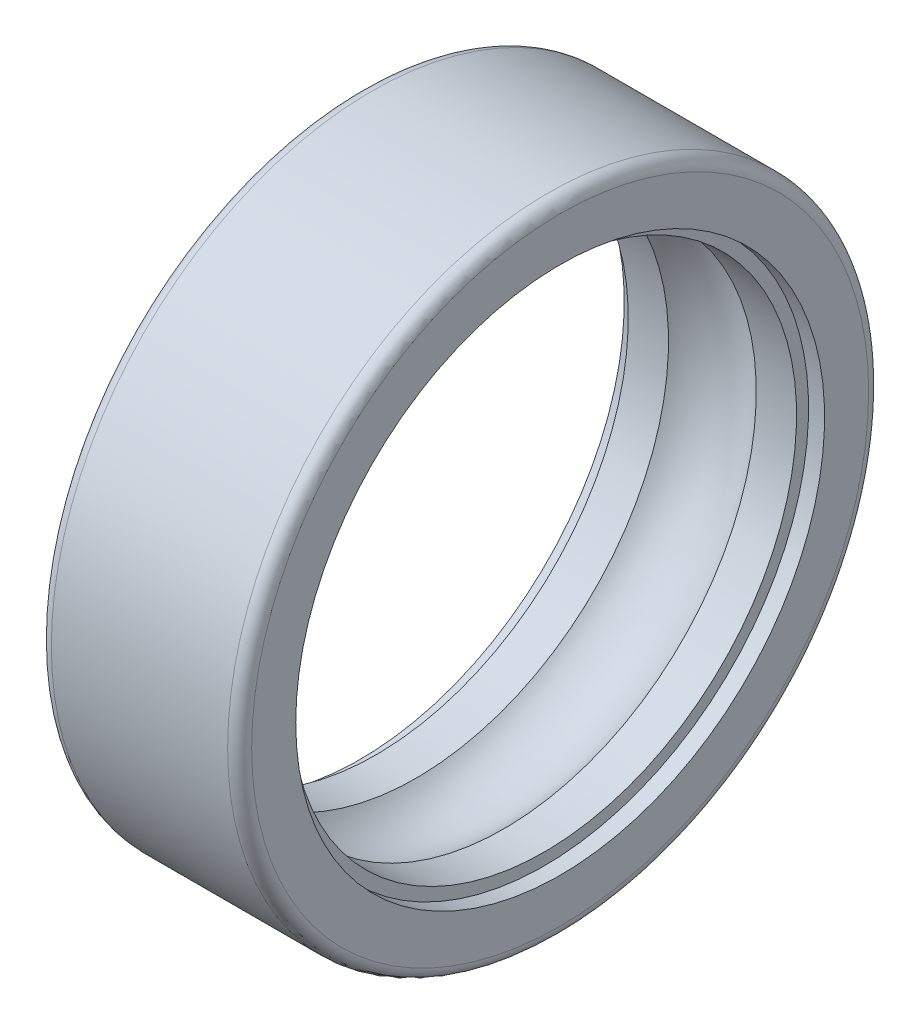
ISO-10303-21;
HEADER;
FILE_DESCRIPTION(('STEP AP214'),'2;1');
FILE_NAME('part.step','',(''),(''),'','','');
FILE_SCHEMA(('AUTOMOTIVE_DESIGN { 1 0 10303 214 1 1 1 1 }'));
ENDSEC;
DATA;
#1=APPLICATION_CONTEXT('core data for automotive mechanical design processes');
#2=APPLICATION_PROTOCOL_DEFINITION('international standard','automotive_design',2000,#1);
#3=PRODUCT_CONTEXT('',#1,'mechanical');
#4=PRODUCT('Part','Part','',(#3));
#5=PRODUCT_RELATED_PRODUCT_CATEGORY('part','',(#4));
#6=PRODUCT_DEFINITION_FORMATION('','',#4);
#7=PRODUCT_DEFINITION_CONTEXT('part definition',#1,'design');
#8=PRODUCT_DEFINITION('design','',#6,#7);
#9=PRODUCT_DEFINITION_SHAPE('','',#8);
#10=(LENGTH_UNIT() NAMED_UNIT(*) SI_UNIT(.MILLI.,.METRE.));
#11=(NAMED_UNIT(*) PLANE_ANGLE_UNIT() SI_UNIT($,.RADIAN.));
#12=(NAMED_UNIT(*) SI_UNIT($,.STERADIAN.) SOLID_ANGLE_UNIT());
#13=UNCERTAINTY_MEASURE_WITH_UNIT(LENGTH_MEASURE(1.E-05),#10,'distance_accuracy_value','');
#14=(GEOMETRIC_REPRESENTATION_CONTEXT(3) GLOBAL_UNCERTAINTY_ASSIGNED_CONTEXT((#13)) GLOBAL_UNIT_ASSIGNED_CONTEXT((#10,
#11,#12)) REPRESENTATION_CONTEXT('',''));
#15=CARTESIAN_POINT('',(0.,0.,0.));
#16=DIRECTION('',(0.,0.,1.));
#17=DIRECTION('',(1.,0.,0.));
#18=AXIS2_PLACEMENT_3D('',#15,#16,#17);
#19=CARTESIAN_POINT('',(2.5,0.,0.));
#20=DIRECTION('',(-1.,0.,0.));
#21=DIRECTION('',(0.,-1.,0.));
#22=AXIS2_PLACEMENT_3D('',#19,#20,#21);
#23=TOROIDAL_SURFACE('',#22,5.275,1.5);
#24=CARTESIAN_POINT('',(1.40484019430953,0.,0.));
#25=DIRECTION('',(1.,0.,0.));
#26=DIRECTION('',(0.,0.,1.));
#27=AXIS2_PLACEMENT_3D('',#24,#25,#26);
#28=CIRCLE('',#27,6.3);
#29=CARTESIAN_POINT('',(1.40484019430953,0.,6.3));
#30=VERTEX_POINT('',#29);
#31=EDGE_CURVE('E140',#30,#30,#28,.T.);
#32=ORIENTED_EDGE('',*,*,#31,.F.);
#33=EDGE_LOOP('',(#32));
#34=FACE_BOUND('',#33,.T.);
#35=CARTESIAN_POINT('',(3.59515980569047,0.,0.));
#36=DIRECTION('',(1.,0.,0.));
#37=DIRECTION('',(0.,0.,1.));
#38=AXIS2_PLACEMENT_3D('',#35,#36,#37);
#39=CIRCLE('',#38,6.3);
#40=CARTESIAN_POINT('',(3.59515980569047,0.,6.3));
#41=VERTEX_POINT('',#40);
#42=EDGE_CURVE('E129',#41,#41,#39,.F.);
#43=ORIENTED_EDGE('',*,*,#42,.F.);
#44=EDGE_LOOP('',(#43));
#45=FACE_BOUND('',#44,.T.);
#46=ADVANCED_FACE('F13',(#34,#45),#23,.F.);
#47=CARTESIAN_POINT('',(4.6,0.,0.));
#48=DIRECTION('',(-1.,0.,0.));
#49=DIRECTION('',(0.,0.,1.));
#50=AXIS2_PLACEMENT_3D('',#47,#48,#49);
#51=CYLINDRICAL_SURFACE('',#50,6.3);
#52=CARTESIAN_POINT('',(4.6,0.,0.));
#53=DIRECTION('',(-1.,0.,0.));
#54=DIRECTION('',(0.,0.,1.));
#55=AXIS2_PLACEMENT_3D('',#52,#53,#54);
#56=CIRCLE('',#55,6.3);
#57=CARTESIAN_POINT('',(4.6,0.,6.3));
#58=VERTEX_POINT('',#57);
#59=EDGE_CURVE('E17',#58,#58,#56,.T.);
#60=ORIENTED_EDGE('',*,*,#59,.F.);
#61=EDGE_LOOP('',(#60));
#62=FACE_BOUND('',#61,.T.);
#63=ORIENTED_EDGE('',*,*,#42,.T.);
#64=EDGE_LOOP('',(#63));
#65=FACE_BOUND('',#64,.T.);
#66=ADVANCED_FACE('F96',(#62,#65),#51,.F.);
#67=CARTESIAN_POINT('',(1.40484019430953,0.,0.));
#68=DIRECTION('',(-1.,0.,0.));
#69=DIRECTION('',(0.,0.,1.));
#70=AXIS2_PLACEMENT_3D('',#67,#68,#69);
#71=CYLINDRICAL_SURFACE('',#70,6.3);
#72=ORIENTED_EDGE('',*,*,#31,.T.);
#73=EDGE_LOOP('',(#72));
#74=FACE_BOUND('',#73,.T.);
#75=CARTESIAN_POINT('',(0.4,0.,0.));
#76=DIRECTION('',(-1.,0.,0.));
#77=DIRECTION('',(0.,0.,1.));
#78=AXIS2_PLACEMENT_3D('',#75,#76,#77);
#79=CIRCLE('',#78,6.3);
#80=CARTESIAN_POINT('',(0.4,0.,6.3));
#81=VERTEX_POINT('',#80);
#82=EDGE_CURVE('E135',#81,#81,#79,.F.);
#83=ORIENTED_EDGE('',*,*,#82,.F.);
#84=EDGE_LOOP('',(#83));
#85=FACE_BOUND('',#84,.T.);
#86=ADVANCED_FACE('F93',(#74,#85),#71,.F.);
#87=CARTESIAN_POINT('',(4.6,0.,6.45));
#88=DIRECTION('',(1.,0.,0.));
#89=DIRECTION('',(0.,0.,-1.));
#90=AXIS2_PLACEMENT_3D('',#87,#88,#89);
#91=PLANE('',#90);
#92=ORIENTED_EDGE('',*,*,#59,.T.);
#93=EDGE_LOOP('',(#92));
#94=FACE_BOUND('',#93,.T.);
#95=CARTESIAN_POINT('',(4.6,0.,0.));
#96=DIRECTION('',(-1.,0.,0.));
#97=DIRECTION('',(0.,0.,1.));
#98=AXIS2_PLACEMENT_3D('',#95,#96,#97);
#99=CIRCLE('',#98,6.6);
#100=CARTESIAN_POINT('',(4.6,0.,6.6));
#101=VERTEX_POINT('',#100);
#102=EDGE_CURVE('E133',#101,#101,#99,.T.);
#103=ORIENTED_EDGE('',*,*,#102,.F.);
#104=EDGE_LOOP('',(#103));
#105=FACE_BOUND('',#104,.T.);
#106=ADVANCED_FACE('F89',(#94,#105),#91,.T.);
#107=CARTESIAN_POINT('',(0.4,0.,6.45));
#108=DIRECTION('',(-1.,0.,0.));
#109=DIRECTION('',(0.,0.,1.));
#110=AXIS2_PLACEMENT_3D('',#107,#108,#109);
#111=PLANE('',#110);
#112=CARTESIAN_POINT('',(0.4,0.,0.));
#113=DIRECTION('',(-1.,0.,0.));
#114=DIRECTION('',(0.,0.,1.));
#115=AXIS2_PLACEMENT_3D('',#112,#113,#114);
#116=CIRCLE('',#115,6.6);
#117=CARTESIAN_POINT('',(0.4,0.,6.6));
#118=VERTEX_POINT('',#117);
#119=EDGE_CURVE('E126',#118,#118,#116,.F.);
#120=ORIENTED_EDGE('',*,*,#119,.F.);
#121=EDGE_LOOP('',(#120));
#122=FACE_BOUND('',#121,.T.);
#123=ORIENTED_EDGE('',*,*,#82,.T.);
#124=EDGE_LOOP('',(#123));
#125=FACE_BOUND('',#124,.T.);
#126=ADVANCED_FACE('F85',(#122,#125),#111,.T.);
#127=CARTESIAN_POINT('',(5.,0.,0.));
#128=DIRECTION('',(-1.,0.,0.));
#129=DIRECTION('',(0.,0.,1.));
#130=AXIS2_PLACEMENT_3D('',#127,#128,#129);
#131=CYLINDRICAL_SURFACE('',#130,6.6);
#132=CARTESIAN_POINT('',(5.,0.,0.));
#133=DIRECTION('',(-1.,0.,0.));
#134=DIRECTION('',(0.,0.,1.));
#135=AXIS2_PLACEMENT_3D('',#132,#133,#134);
#136=CIRCLE('',#135,6.6);
#137=CARTESIAN_POINT('',(5.,0.,6.6));
#138=VERTEX_POINT('',#137);
#139=EDGE_CURVE('E121',#138,#138,#136,.T.);
#140=ORIENTED_EDGE('',*,*,#139,.F.);
#141=EDGE_LOOP('',(#140));
#142=FACE_BOUND('',#141,.T.);
#143=ORIENTED_EDGE('',*,*,#102,.T.);
#144=EDGE_LOOP('',(#143));
#145=FACE_BOUND('',#144,.T.);
#146=ADVANCED_FACE('F81',(#142,#145),#131,.F.);
#147=CARTESIAN_POINT('',(0.4,0.,0.));
#148=DIRECTION('',(-1.,0.,0.));
#149=DIRECTION('',(0.,0.,1.));
#150=AXIS2_PLACEMENT_3D('',#147,#148,#149);
#151=CYLINDRICAL_SURFACE('',#150,6.6);
#152=ORIENTED_EDGE('',*,*,#119,.T.);
#153=EDGE_LOOP('',(#152));
#154=FACE_BOUND('',#153,.T.);
#155=CARTESIAN_POINT('',(0.,0.,0.));
#156=DIRECTION('',(-1.,0.,0.));
#157=DIRECTION('',(0.,0.,1.));
#158=AXIS2_PLACEMENT_3D('',#155,#156,#157);
#159=CIRCLE('',#158,6.6);
#160=CARTESIAN_POINT('',(0.,0.,6.6));
#161=VERTEX_POINT('',#160);
#162=EDGE_CURVE('E119',#161,#161,#159,.F.);
#163=ORIENTED_EDGE('',*,*,#162,.F.);
#164=EDGE_LOOP('',(#163));
#165=FACE_BOUND('',#164,.T.);
#166=ADVANCED_FACE('F76',(#154,#165),#151,.F.);
#167=CARTESIAN_POINT('',(5.,0.,7.15));
#168=DIRECTION('',(1.,0.,0.));
#169=DIRECTION('',(0.,0.,-1.));
#170=AXIS2_PLACEMENT_3D('',#167,#168,#169);
#171=PLANE('',#170);
#172=ORIENTED_EDGE('',*,*,#139,.T.);
#173=EDGE_LOOP('',(#172));
#174=FACE_BOUND('',#173,.T.);
#175=CARTESIAN_POINT('',(5.,0.,0.));
#176=DIRECTION('',(-1.,0.,0.));
#177=DIRECTION('',(0.,0.,1.));
#178=AXIS2_PLACEMENT_3D('',#175,#176,#177);
#179=CIRCLE('',#178,7.7);
#180=CARTESIAN_POINT('',(5.,0.,7.7));
#181=VERTEX_POINT('',#180);
#182=EDGE_CURVE('E60',#181,#181,#179,.T.);
#183=ORIENTED_EDGE('',*,*,#182,.F.);
#184=EDGE_LOOP('',(#183));
#185=FACE_BOUND('',#184,.T.);
#186=ADVANCED_FACE('F66',(#174,#185),#171,.T.);
#187=CARTESIAN_POINT('',(0.,0.,7.15));
#188=DIRECTION('',(-1.,0.,0.));
#189=DIRECTION('',(0.,0.,1.));
#190=AXIS2_PLACEMENT_3D('',#187,#188,#189);
#191=PLANE('',#190);
#192=CARTESIAN_POINT('',(0.,0.,0.));
#193=DIRECTION('',(1.,0.,0.));
#194=DIRECTION('',(0.,0.,1.));
#195=AXIS2_PLACEMENT_3D('',#192,#193,#194);
#196=CIRCLE('',#195,7.7);
#197=CARTESIAN_POINT('',(0.,0.,7.7));
#198=VERTEX_POINT('',#197);
#199=EDGE_CURVE('E26',#198,#198,#196,.T.);
#200=ORIENTED_EDGE('',*,*,#199,.F.);
#201=EDGE_LOOP('',(#200));
#202=FACE_BOUND('',#201,.T.);
#203=ORIENTED_EDGE('',*,*,#162,.T.);
#204=EDGE_LOOP('',(#203));
#205=FACE_BOUND('',#204,.T.);
#206=ADVANCED_FACE('F75',(#202,#205),#191,.T.);
#207=CARTESIAN_POINT('',(4.7,0.,0.));
#208=DIRECTION('',(-1.,0.,0.));
#209=DIRECTION('',(0.,-1.,0.));
#210=AXIS2_PLACEMENT_3D('',#207,#208,#209);
#211=TOROIDAL_SURFACE('',#210,7.7,0.300000000000001);
#212=ORIENTED_EDGE('',*,*,#182,.T.);
#213=EDGE_LOOP('',(#212));
#214=FACE_BOUND('',#213,.T.);
#215=CARTESIAN_POINT('',(4.7,0.,0.));
#216=DIRECTION('',(-1.,0.,0.));
#217=DIRECTION('',(0.,0.,1.));
#218=AXIS2_PLACEMENT_3D('',#215,#216,#217);
#219=CIRCLE('',#218,8.);
#220=CARTESIAN_POINT('',(4.7,0.,8.));
#221=VERTEX_POINT('',#220);
#222=EDGE_CURVE('E21',#221,#221,#219,.T.);
#223=ORIENTED_EDGE('',*,*,#222,.F.);
#224=EDGE_LOOP('',(#223));
#225=FACE_BOUND('',#224,.T.);
#226=ADVANCED_FACE('F40',(#214,#225),#211,.T.);
#227=CARTESIAN_POINT('',(0.3,0.,0.));
#228=DIRECTION('',(-1.,0.,0.));
#229=DIRECTION('',(0.,-1.,0.));
#230=AXIS2_PLACEMENT_3D('',#227,#228,#229);
#231=TOROIDAL_SURFACE('',#230,7.7,0.3);
#232=CARTESIAN_POINT('',(0.3,0.,0.));
#233=DIRECTION('',(-1.,0.,0.));
#234=DIRECTION('',(0.,0.,1.));
#235=AXIS2_PLACEMENT_3D('',#232,#233,#234);
#236=CIRCLE('',#235,8.);
#237=CARTESIAN_POINT('',(0.3,0.,8.));
#238=VERTEX_POINT('',#237);
#239=EDGE_CURVE('E9',#238,#238,#236,.F.);
#240=ORIENTED_EDGE('',*,*,#239,.F.);
#241=EDGE_LOOP('',(#240));
#242=FACE_BOUND('',#241,.T.);
#243=ORIENTED_EDGE('',*,*,#199,.T.);
#244=EDGE_LOOP('',(#243));
#245=FACE_BOUND('',#244,.T.);
#246=ADVANCED_FACE('F34',(#242,#245),#231,.T.);
#247=CARTESIAN_POINT('',(2.5,0.,0.));
#248=DIRECTION('',(-1.,0.,0.));
#249=DIRECTION('',(0.,0.,1.));
#250=AXIS2_PLACEMENT_3D('',#247,#248,#249);
#251=CYLINDRICAL_SURFACE('',#250,8.);
#252=ORIENTED_EDGE('',*,*,#222,.T.);
#253=EDGE_LOOP('',(#252));
#254=FACE_BOUND('',#253,.T.);
#255=ORIENTED_EDGE('',*,*,#239,.T.);
#256=EDGE_LOOP('',(#255));
#257=FACE_BOUND('',#256,.T.);
#258=ADVANCED_FACE('F39',(#254,#257),#251,.T.);
#259=CLOSED_SHELL('',(#46,#66,#86,#106,#126,#146,#166,#186,#206,#226,#246,#258));
#260=MANIFOLD_SOLID_BREP('B1',#259);
#261=ADVANCED_BREP_SHAPE_REPRESENTATION('',(#18,#260),#14);
#262=SHAPE_DEFINITION_REPRESENTATION(#9,#261);
ENDSEC;
END-ISO-10303-21;
